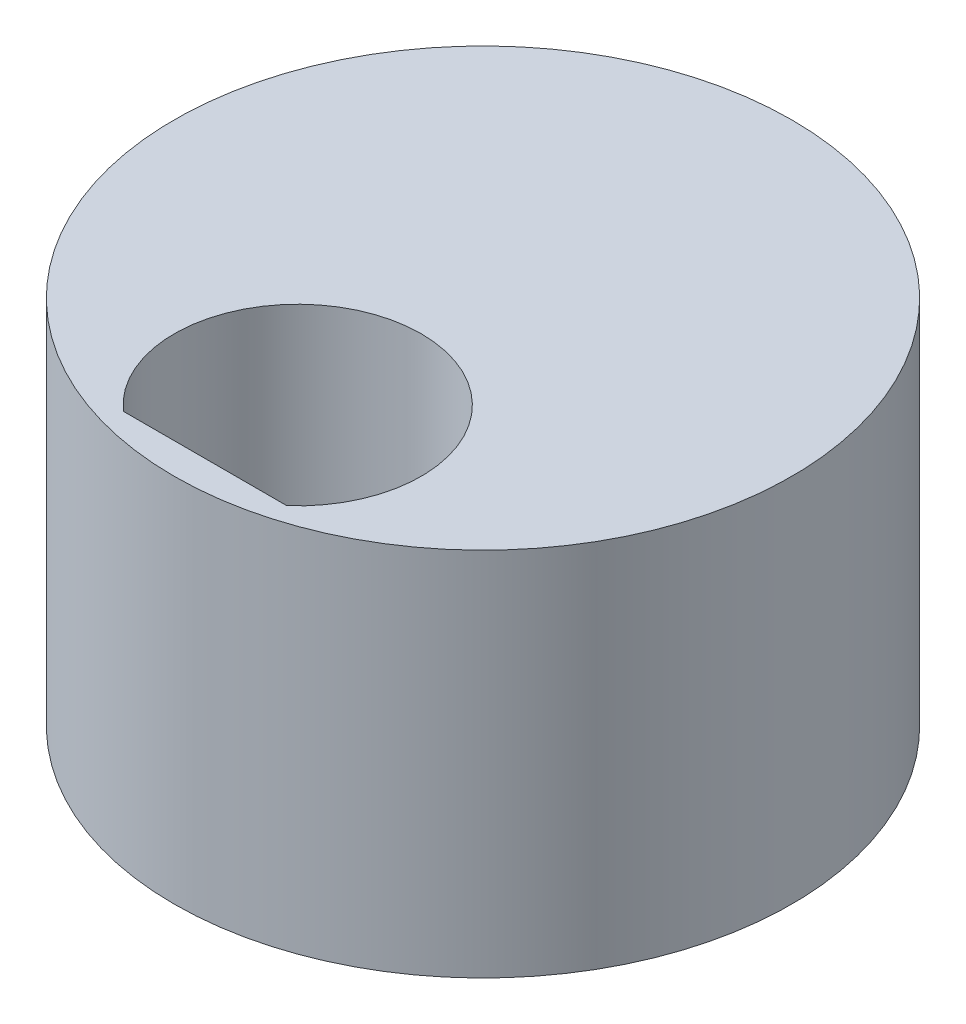
ISO-10303-21;
HEADER;
FILE_DESCRIPTION(('STEP AP214'),'2;1');
FILE_NAME('part.step','',(''),(''),'','','');
FILE_SCHEMA(('AUTOMOTIVE_DESIGN { 1 0 10303 214 1 1 1 1 }'));
ENDSEC;
DATA;
#1=APPLICATION_CONTEXT('core data for automotive mechanical design processes');
#2=APPLICATION_PROTOCOL_DEFINITION('international standard','automotive_design',2000,#1);
#3=PRODUCT_CONTEXT('',#1,'mechanical');
#4=PRODUCT('Part','Part','',(#3));
#5=PRODUCT_RELATED_PRODUCT_CATEGORY('part','',(#4));
#6=PRODUCT_DEFINITION_FORMATION('','',#4);
#7=PRODUCT_DEFINITION_CONTEXT('part definition',#1,'design');
#8=PRODUCT_DEFINITION('design','',#6,#7);
#9=PRODUCT_DEFINITION_SHAPE('','',#8);
#10=(LENGTH_UNIT() NAMED_UNIT(*) SI_UNIT(.MILLI.,.METRE.));
#11=(NAMED_UNIT(*) PLANE_ANGLE_UNIT() SI_UNIT($,.RADIAN.));
#12=(NAMED_UNIT(*) SI_UNIT($,.STERADIAN.) SOLID_ANGLE_UNIT());
#13=UNCERTAINTY_MEASURE_WITH_UNIT(LENGTH_MEASURE(1.E-05),#10,'distance_accuracy_value','');
#14=(GEOMETRIC_REPRESENTATION_CONTEXT(3) GLOBAL_UNCERTAINTY_ASSIGNED_CONTEXT((#13)) GLOBAL_UNIT_ASSIGNED_CONTEXT((#10,
#11,#12)) REPRESENTATION_CONTEXT('',''));
#15=CARTESIAN_POINT('',(0.,0.,0.));
#16=DIRECTION('',(0.,0.,1.));
#17=DIRECTION('',(1.,0.,0.));
#18=AXIS2_PLACEMENT_3D('',#15,#16,#17);
#19=CARTESIAN_POINT('',(0.,6.,0.));
#20=DIRECTION('',(0.,1.,0.));
#21=DIRECTION('',(0.,0.,1.));
#22=AXIS2_PLACEMENT_3D('',#19,#20,#21);
#23=PLANE('',#22);
#24=CARTESIAN_POINT('',(0.,6.,0.));
#25=DIRECTION('',(0.,1.,0.));
#26=DIRECTION('',(0.,0.,1.));
#27=AXIS2_PLACEMENT_3D('',#24,#25,#26);
#28=CIRCLE('',#27,5.);
#29=CARTESIAN_POINT('',(0.,6.,5.));
#30=VERTEX_POINT('',#29);
#31=EDGE_CURVE('E11',#30,#30,#28,.T.);
#32=ORIENTED_EDGE('',*,*,#31,.T.);
#33=EDGE_LOOP('',(#32));
#34=FACE_BOUND('',#33,.T.);
#35=DIRECTION('',(1.,0.,0.));
#36=VECTOR('',#35,1.);
#37=CARTESIAN_POINT('',(1.3228756555323,6.,4.5));
#38=LINE('',#37,#36);
#39=CARTESIAN_POINT('',(-1.3228756555323,6.,4.5));
#40=VERTEX_POINT('',#39);
#41=CARTESIAN_POINT('',(1.3228756555323,6.,4.5));
#42=VERTEX_POINT('',#41);
#43=EDGE_CURVE('E90',#40,#42,#38,.T.);
#44=ORIENTED_EDGE('',*,*,#43,.F.);
#45=CARTESIAN_POINT('',(0.,6.,3.));
#46=DIRECTION('',(0.,1.,0.));
#47=DIRECTION('',(0.,0.,1.));
#48=AXIS2_PLACEMENT_3D('',#45,#46,#47);
#49=CIRCLE('',#48,2.);
#50=EDGE_CURVE('E79',#42,#40,#49,.T.);
#51=ORIENTED_EDGE('',*,*,#50,.F.);
#52=EDGE_LOOP('',(#44,#51));
#53=FACE_BOUND('',#52,.T.);
#54=ADVANCED_FACE('F45',(#34,#53),#23,.T.);
#55=CARTESIAN_POINT('',(0.,0.,0.));
#56=DIRECTION('',(0.,1.,0.));
#57=DIRECTION('',(0.,0.,1.));
#58=AXIS2_PLACEMENT_3D('',#55,#56,#57);
#59=PLANE('',#58);
#60=CARTESIAN_POINT('',(0.,0.,0.));
#61=DIRECTION('',(0.,1.,0.));
#62=DIRECTION('',(0.,0.,1.));
#63=AXIS2_PLACEMENT_3D('',#60,#61,#62);
#64=CIRCLE('',#63,5.);
#65=CARTESIAN_POINT('',(0.,0.,5.));
#66=VERTEX_POINT('',#65);
#67=EDGE_CURVE('E49',#66,#66,#64,.T.);
#68=ORIENTED_EDGE('',*,*,#67,.F.);
#69=EDGE_LOOP('',(#68));
#70=FACE_BOUND('',#69,.T.);
#71=CARTESIAN_POINT('',(0.,0.,3.));
#72=DIRECTION('',(0.,1.,0.));
#73=DIRECTION('',(0.,0.,1.));
#74=AXIS2_PLACEMENT_3D('',#71,#72,#73);
#75=CIRCLE('',#74,2.);
#76=CARTESIAN_POINT('',(1.3228756555323,0.,4.5));
#77=VERTEX_POINT('',#76);
#78=CARTESIAN_POINT('',(-1.3228756555323,0.,4.5));
#79=VERTEX_POINT('',#78);
#80=EDGE_CURVE('E68',#77,#79,#75,.T.);
#81=ORIENTED_EDGE('',*,*,#80,.T.);
#82=DIRECTION('',(1.,0.,0.));
#83=VECTOR('',#82,1.);
#84=CARTESIAN_POINT('',(1.3228756555323,0.,4.5));
#85=LINE('',#84,#83);
#86=EDGE_CURVE('E74',#79,#77,#85,.T.);
#87=ORIENTED_EDGE('',*,*,#86,.T.);
#88=EDGE_LOOP('',(#81,#87));
#89=FACE_BOUND('',#88,.T.);
#90=ADVANCED_FACE('F86',(#70,#89),#59,.F.);
#91=CARTESIAN_POINT('',(0.,6.,0.));
#92=DIRECTION('',(0.,-1.,0.));
#93=DIRECTION('',(0.,0.,-1.));
#94=AXIS2_PLACEMENT_3D('',#91,#92,#93);
#95=CYLINDRICAL_SURFACE('',#94,5.);
#96=ORIENTED_EDGE('',*,*,#31,.F.);
#97=EDGE_LOOP('',(#96));
#98=FACE_BOUND('',#97,.T.);
#99=ORIENTED_EDGE('',*,*,#67,.T.);
#100=EDGE_LOOP('',(#99));
#101=FACE_BOUND('',#100,.T.);
#102=ADVANCED_FACE('F47',(#98,#101),#95,.T.);
#103=CARTESIAN_POINT('',(0.,6.,3.));
#104=DIRECTION('',(0.,-1.,0.));
#105=DIRECTION('',(0.,0.,-1.));
#106=AXIS2_PLACEMENT_3D('',#103,#104,#105);
#107=CYLINDRICAL_SURFACE('',#106,2.);
#108=ORIENTED_EDGE('',*,*,#80,.F.);
#109=DIRECTION('',(0.,-1.,0.));
#110=VECTOR('',#109,1.);
#111=CARTESIAN_POINT('',(1.3228756555323,6.,4.5));
#112=LINE('',#111,#110);
#113=EDGE_CURVE('E76',#42,#77,#112,.T.);
#114=ORIENTED_EDGE('',*,*,#113,.F.);
#115=ORIENTED_EDGE('',*,*,#50,.T.);
#116=DIRECTION('',(0.,-1.,0.));
#117=VECTOR('',#116,1.);
#118=CARTESIAN_POINT('',(-1.3228756555323,6.,4.5));
#119=LINE('',#118,#117);
#120=EDGE_CURVE('E61',#40,#79,#119,.T.);
#121=ORIENTED_EDGE('',*,*,#120,.T.);
#122=EDGE_LOOP('',(#108,#114,#115,#121));
#123=FACE_BOUND('',#122,.T.);
#124=ADVANCED_FACE('F81',(#123),#107,.F.);
#125=CARTESIAN_POINT('',(1.3228756555323,6.,4.5));
#126=DIRECTION('',(0.,0.,-1.));
#127=DIRECTION('',(-1.,0.,0.));
#128=AXIS2_PLACEMENT_3D('',#125,#126,#127);
#129=PLANE('',#128);
#130=ORIENTED_EDGE('',*,*,#86,.F.);
#131=ORIENTED_EDGE('',*,*,#120,.F.);
#132=ORIENTED_EDGE('',*,*,#43,.T.);
#133=ORIENTED_EDGE('',*,*,#113,.T.);
#134=EDGE_LOOP('',(#130,#131,#132,#133));
#135=FACE_BOUND('',#134,.T.);
#136=ADVANCED_FACE('F75',(#135),#129,.T.);
#137=CLOSED_SHELL('',(#54,#90,#102,#124,#136));
#138=MANIFOLD_SOLID_BREP('B2',#137);
#139=ADVANCED_BREP_SHAPE_REPRESENTATION('',(#18,#138),#14);
#140=SHAPE_DEFINITION_REPRESENTATION(#9,#139);
ENDSEC;
END-ISO-10303-21;
